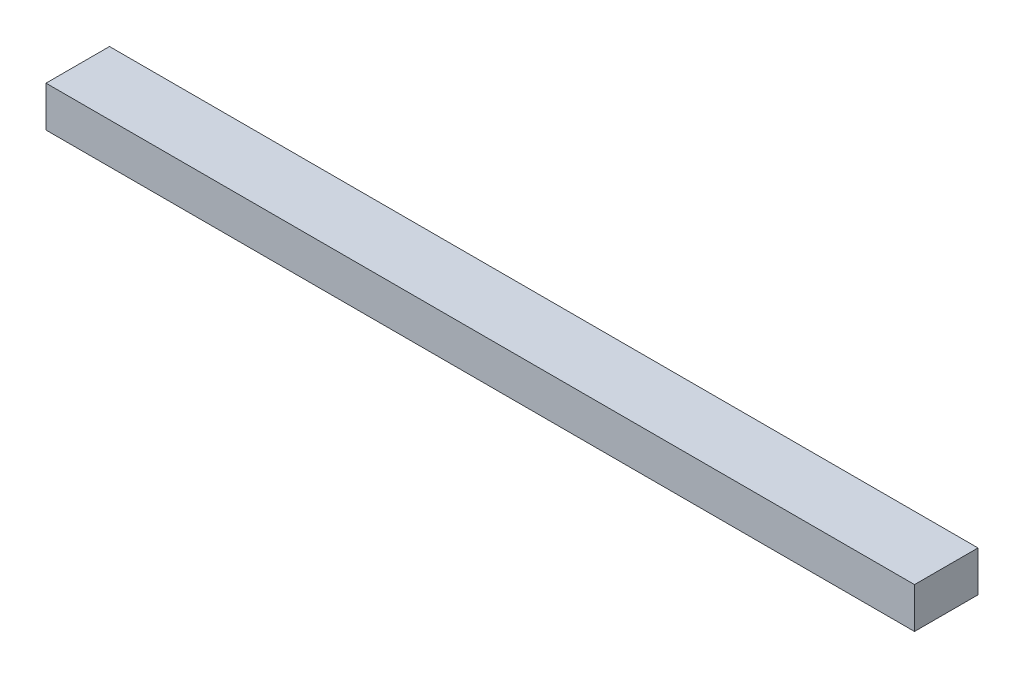
ISO-10303-21;
HEADER;
FILE_DESCRIPTION(('STEP AP214'),'2;1');
FILE_NAME('part.step','',(''),(''),'','','');
FILE_SCHEMA(('AUTOMOTIVE_DESIGN { 1 0 10303 214 1 1 1 1 }'));
ENDSEC;
DATA;
#1=APPLICATION_CONTEXT('core data for automotive mechanical design processes');
#2=APPLICATION_PROTOCOL_DEFINITION('international standard','automotive_design',2000,#1);
#3=PRODUCT_CONTEXT('',#1,'mechanical');
#4=PRODUCT('Part','Part','',(#3));
#5=PRODUCT_RELATED_PRODUCT_CATEGORY('part','',(#4));
#6=PRODUCT_DEFINITION_FORMATION('','',#4);
#7=PRODUCT_DEFINITION_CONTEXT('part definition',#1,'design');
#8=PRODUCT_DEFINITION('design','',#6,#7);
#9=PRODUCT_DEFINITION_SHAPE('','',#8);
#10=(LENGTH_UNIT() NAMED_UNIT(*) SI_UNIT(.MILLI.,.METRE.));
#11=(NAMED_UNIT(*) PLANE_ANGLE_UNIT() SI_UNIT($,.RADIAN.));
#12=(NAMED_UNIT(*) SI_UNIT($,.STERADIAN.) SOLID_ANGLE_UNIT());
#13=UNCERTAINTY_MEASURE_WITH_UNIT(LENGTH_MEASURE(1.E-05),#10,'distance_accuracy_value','');
#14=(GEOMETRIC_REPRESENTATION_CONTEXT(3) GLOBAL_UNCERTAINTY_ASSIGNED_CONTEXT((#13)) GLOBAL_UNIT_ASSIGNED_CONTEXT((#10,
#11,#12)) REPRESENTATION_CONTEXT('',''));
#15=CARTESIAN_POINT('',(0.,0.,0.));
#16=DIRECTION('',(0.,0.,1.));
#17=DIRECTION('',(1.,0.,0.));
#18=AXIS2_PLACEMENT_3D('',#15,#16,#17);
#19=CARTESIAN_POINT('',(200.999999999999,-193.00000000004,25.));
#20=DIRECTION('',(-1.,0.,0.));
#21=DIRECTION('',(0.,0.,1.));
#22=AXIS2_PLACEMENT_3D('',#19,#20,#21);
#23=PLANE('',#22);
#24=DIRECTION('',(0.,1.,0.));
#25=VECTOR('',#24,1.);
#26=CARTESIAN_POINT('',(200.999999999999,-193.00000000004,0.));
#27=LINE('',#26,#25);
#28=CARTESIAN_POINT('',(200.999999999999,-193.00000000004,0.));
#29=VERTEX_POINT('',#28);
#30=CARTESIAN_POINT('',(200.999999999999,-177.00000000004,0.));
#31=VERTEX_POINT('',#30);
#32=EDGE_CURVE('E96',#29,#31,#27,.T.);
#33=ORIENTED_EDGE('',*,*,#32,.T.);
#34=DIRECTION('',(0.,0.,-1.));
#35=VECTOR('',#34,1.);
#36=CARTESIAN_POINT('',(200.999999999999,-177.00000000004,25.));
#37=LINE('',#36,#35);
#38=CARTESIAN_POINT('',(200.999999999999,-177.00000000004,25.));
#39=VERTEX_POINT('',#38);
#40=EDGE_CURVE('E11',#39,#31,#37,.T.);
#41=ORIENTED_EDGE('',*,*,#40,.F.);
#42=DIRECTION('',(0.,1.,0.));
#43=VECTOR('',#42,1.);
#44=CARTESIAN_POINT('',(200.999999999999,-193.00000000004,25.));
#45=LINE('',#44,#43);
#46=CARTESIAN_POINT('',(200.999999999999,-193.00000000004,25.));
#47=VERTEX_POINT('',#46);
#48=EDGE_CURVE('E84',#47,#39,#45,.T.);
#49=ORIENTED_EDGE('',*,*,#48,.F.);
#50=DIRECTION('',(0.,0.,-1.));
#51=VECTOR('',#50,1.);
#52=CARTESIAN_POINT('',(200.999999999999,-193.00000000004,25.));
#53=LINE('',#52,#51);
#54=EDGE_CURVE('E92',#47,#29,#53,.T.);
#55=ORIENTED_EDGE('',*,*,#54,.T.);
#56=EDGE_LOOP('',(#33,#41,#49,#55));
#57=FACE_BOUND('',#56,.T.);
#58=ADVANCED_FACE('F33',(#57),#23,.F.);
#59=CARTESIAN_POINT('',(200.999999999999,-177.00000000004,25.));
#60=DIRECTION('',(0.,-1.,0.));
#61=DIRECTION('',(1.,0.,0.));
#62=AXIS2_PLACEMENT_3D('',#59,#60,#61);
#63=PLANE('',#62);
#64=DIRECTION('',(-1.,0.,0.));
#65=VECTOR('',#64,1.);
#66=CARTESIAN_POINT('',(200.999999999999,-177.00000000004,0.));
#67=LINE('',#66,#65);
#68=CARTESIAN_POINT('',(-141.,-177.00000000004,0.));
#69=VERTEX_POINT('',#68);
#70=EDGE_CURVE('E88',#31,#69,#67,.T.);
#71=ORIENTED_EDGE('',*,*,#70,.T.);
#72=DIRECTION('',(0.,0.,-1.));
#73=VECTOR('',#72,1.);
#74=CARTESIAN_POINT('',(-141.,-177.00000000004,25.));
#75=LINE('',#74,#73);
#76=CARTESIAN_POINT('',(-141.,-177.00000000004,25.));
#77=VERTEX_POINT('',#76);
#78=EDGE_CURVE('E41',#77,#69,#75,.T.);
#79=ORIENTED_EDGE('',*,*,#78,.F.);
#80=DIRECTION('',(-1.,0.,0.));
#81=VECTOR('',#80,1.);
#82=CARTESIAN_POINT('',(200.999999999999,-177.00000000004,25.));
#83=LINE('',#82,#81);
#84=EDGE_CURVE('E79',#39,#77,#83,.T.);
#85=ORIENTED_EDGE('',*,*,#84,.F.);
#86=ORIENTED_EDGE('',*,*,#40,.T.);
#87=EDGE_LOOP('',(#71,#79,#85,#86));
#88=FACE_BOUND('',#87,.T.);
#89=ADVANCED_FACE('F87',(#88),#63,.F.);
#90=CARTESIAN_POINT('',(-141.,-193.00000000004,25.));
#91=DIRECTION('',(1.,0.,0.));
#92=DIRECTION('',(0.,0.,-1.));
#93=AXIS2_PLACEMENT_3D('',#90,#91,#92);
#94=PLANE('',#93);
#95=DIRECTION('',(0.,-1.,0.));
#96=VECTOR('',#95,1.);
#97=CARTESIAN_POINT('',(-141.,-193.00000000004,0.));
#98=LINE('',#97,#96);
#99=CARTESIAN_POINT('',(-141.,-193.00000000004,0.));
#100=VERTEX_POINT('',#99);
#101=EDGE_CURVE('E66',#69,#100,#98,.T.);
#102=ORIENTED_EDGE('',*,*,#101,.T.);
#103=DIRECTION('',(0.,0.,-1.));
#104=VECTOR('',#103,1.);
#105=CARTESIAN_POINT('',(-141.,-193.00000000004,25.));
#106=LINE('',#105,#104);
#107=CARTESIAN_POINT('',(-141.,-193.00000000004,25.));
#108=VERTEX_POINT('',#107);
#109=EDGE_CURVE('E89',#108,#100,#106,.T.);
#110=ORIENTED_EDGE('',*,*,#109,.F.);
#111=DIRECTION('',(0.,-1.,0.));
#112=VECTOR('',#111,1.);
#113=CARTESIAN_POINT('',(-141.,-193.00000000004,25.));
#114=LINE('',#113,#112);
#115=EDGE_CURVE('E82',#77,#108,#114,.T.);
#116=ORIENTED_EDGE('',*,*,#115,.F.);
#117=ORIENTED_EDGE('',*,*,#78,.T.);
#118=EDGE_LOOP('',(#102,#110,#116,#117));
#119=FACE_BOUND('',#118,.T.);
#120=ADVANCED_FACE('F90',(#119),#94,.F.);
#121=CARTESIAN_POINT('',(200.999999999999,-193.00000000004,25.));
#122=DIRECTION('',(0.,1.,0.));
#123=DIRECTION('',(0.,0.,1.));
#124=AXIS2_PLACEMENT_3D('',#121,#122,#123);
#125=PLANE('',#124);
#126=DIRECTION('',(1.,0.,0.));
#127=VECTOR('',#126,1.);
#128=CARTESIAN_POINT('',(200.999999999999,-193.00000000004,0.));
#129=LINE('',#128,#127);
#130=EDGE_CURVE('E72',#100,#29,#129,.T.);
#131=ORIENTED_EDGE('',*,*,#130,.T.);
#132=ORIENTED_EDGE('',*,*,#54,.F.);
#133=DIRECTION('',(1.,0.,0.));
#134=VECTOR('',#133,1.);
#135=CARTESIAN_POINT('',(200.999999999999,-193.00000000004,25.));
#136=LINE('',#135,#134);
#137=EDGE_CURVE('E49',#108,#47,#136,.T.);
#138=ORIENTED_EDGE('',*,*,#137,.F.);
#139=ORIENTED_EDGE('',*,*,#109,.T.);
#140=EDGE_LOOP('',(#131,#132,#138,#139));
#141=FACE_BOUND('',#140,.T.);
#142=ADVANCED_FACE('F103',(#141),#125,.F.);
#143=CARTESIAN_POINT('',(0.,0.,25.));
#144=DIRECTION('',(0.,0.,1.));
#145=DIRECTION('',(1.,0.,0.));
#146=AXIS2_PLACEMENT_3D('',#143,#144,#145);
#147=PLANE('',#146);
#148=ORIENTED_EDGE('',*,*,#48,.T.);
#149=ORIENTED_EDGE('',*,*,#84,.T.);
#150=ORIENTED_EDGE('',*,*,#115,.T.);
#151=ORIENTED_EDGE('',*,*,#137,.T.);
#152=EDGE_LOOP('',(#148,#149,#150,#151));
#153=FACE_BOUND('',#152,.T.);
#154=ADVANCED_FACE('F80',(#153),#147,.T.);
#155=CARTESIAN_POINT('',(0.,0.,0.));
#156=DIRECTION('',(0.,0.,1.));
#157=DIRECTION('',(1.,0.,0.));
#158=AXIS2_PLACEMENT_3D('',#155,#156,#157);
#159=PLANE('',#158);
#160=ORIENTED_EDGE('',*,*,#32,.F.);
#161=ORIENTED_EDGE('',*,*,#130,.F.);
#162=ORIENTED_EDGE('',*,*,#101,.F.);
#163=ORIENTED_EDGE('',*,*,#70,.F.);
#164=EDGE_LOOP('',(#160,#161,#162,#163));
#165=FACE_BOUND('',#164,.T.);
#166=ADVANCED_FACE('F106',(#165),#159,.F.);
#167=CLOSED_SHELL('',(#58,#89,#120,#142,#154,#166));
#168=MANIFOLD_SOLID_BREP('B2',#167);
#169=ADVANCED_BREP_SHAPE_REPRESENTATION('',(#18,#168),#14);
#170=SHAPE_DEFINITION_REPRESENTATION(#9,#169);
ENDSEC;
END-ISO-10303-21;
